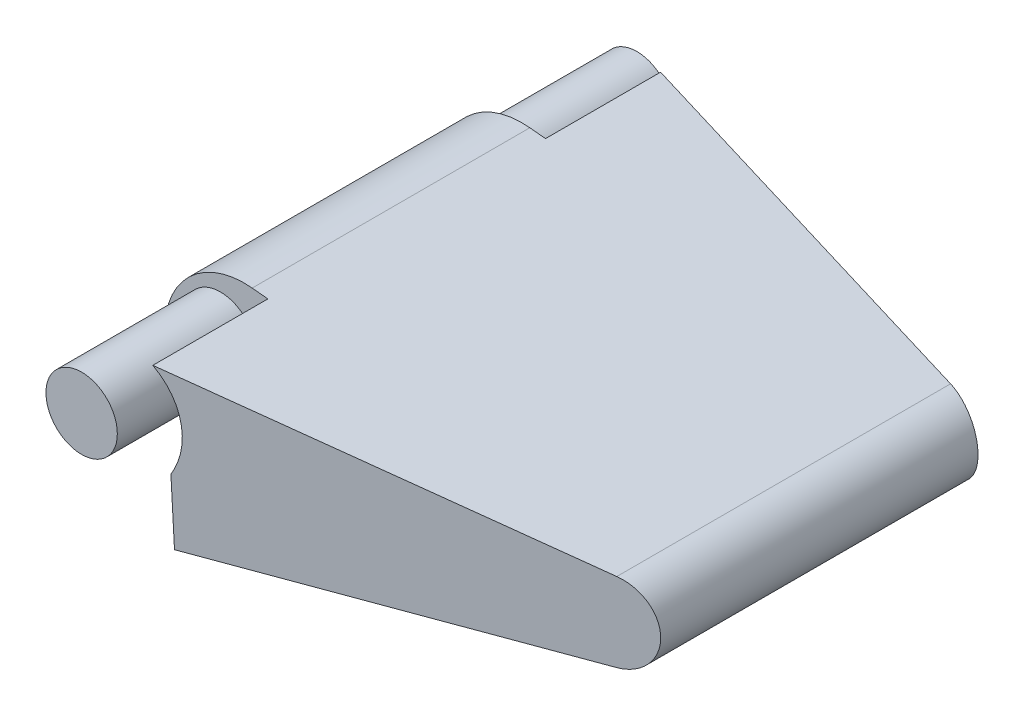
ISO-10303-21;
HEADER;
FILE_DESCRIPTION(('STEP AP214'),'2;1');
FILE_NAME('part.step','',(''),(''),'','','');
FILE_SCHEMA(('AUTOMOTIVE_DESIGN { 1 0 10303 214 1 1 1 1 }'));
ENDSEC;
DATA;
#1=APPLICATION_CONTEXT('core data for automotive mechanical design processes');
#2=APPLICATION_PROTOCOL_DEFINITION('international standard','automotive_design',2000,#1);
#3=PRODUCT_CONTEXT('',#1,'mechanical');
#4=PRODUCT('Part','Part','',(#3));
#5=PRODUCT_RELATED_PRODUCT_CATEGORY('part','',(#4));
#6=PRODUCT_DEFINITION_FORMATION('','',#4);
#7=PRODUCT_DEFINITION_CONTEXT('part definition',#1,'design');
#8=PRODUCT_DEFINITION('design','',#6,#7);
#9=PRODUCT_DEFINITION_SHAPE('','',#8);
#10=(LENGTH_UNIT() NAMED_UNIT(*) SI_UNIT(.MILLI.,.METRE.));
#11=(NAMED_UNIT(*) PLANE_ANGLE_UNIT() SI_UNIT($,.RADIAN.));
#12=(NAMED_UNIT(*) SI_UNIT($,.STERADIAN.) SOLID_ANGLE_UNIT());
#13=UNCERTAINTY_MEASURE_WITH_UNIT(LENGTH_MEASURE(1.E-05),#10,'distance_accuracy_value','');
#14=(GEOMETRIC_REPRESENTATION_CONTEXT(3) GLOBAL_UNCERTAINTY_ASSIGNED_CONTEXT((#13)) GLOBAL_UNIT_ASSIGNED_CONTEXT((#10,
#11,#12)) REPRESENTATION_CONTEXT('',''));
#15=CARTESIAN_POINT('',(0.,0.,0.));
#16=DIRECTION('',(0.,0.,1.));
#17=DIRECTION('',(1.,0.,0.));
#18=AXIS2_PLACEMENT_3D('',#15,#16,#17);
#19=CARTESIAN_POINT('',(0.,0.,22.225));
#20=DIRECTION('',(0.,0.,-1.));
#21=DIRECTION('',(-1.,0.,0.));
#22=AXIS2_PLACEMENT_3D('',#19,#20,#21);
#23=CYLINDRICAL_SURFACE('',#22,6.35);
#24=CARTESIAN_POINT('',(0.,0.,-7.14375));
#25=DIRECTION('',(0.,0.,1.));
#26=DIRECTION('',(1.,0.,0.));
#27=AXIS2_PLACEMENT_3D('',#24,#25,#26);
#28=CIRCLE('',#27,6.35);
#29=CARTESIAN_POINT('',(-4.93940634195103,3.99058454228123,-7.14375));
#30=VERTEX_POINT('',#29);
#31=CARTESIAN_POINT('',(0.634999999999998,-6.31817022562703,-7.14375));
#32=VERTEX_POINT('',#31);
#33=EDGE_CURVE('E171',#30,#32,#28,.T.);
#34=ORIENTED_EDGE('',*,*,#33,.F.);
#35=DIRECTION('',(0.,0.,1.));
#36=VECTOR('',#35,1.);
#37=CARTESIAN_POINT('',(-4.93940634195103,3.99058454228123,-7.14375));
#38=LINE('',#37,#36);
#39=CARTESIAN_POINT('',(-4.93940634195103,3.99058454228123,-0.79375));
#40=VERTEX_POINT('',#39);
#41=EDGE_CURVE('E157',#30,#40,#38,.T.);
#42=ORIENTED_EDGE('',*,*,#41,.T.);
#43=CARTESIAN_POINT('',(0.,0.,-0.793749999999999));
#44=DIRECTION('',(0.,0.,1.));
#45=DIRECTION('',(1.,0.,0.));
#46=AXIS2_PLACEMENT_3D('',#43,#44,#45);
#47=CIRCLE('',#46,6.35);
#48=CARTESIAN_POINT('',(0.634999999999998,-6.31817022562703,-0.79375));
#49=VERTEX_POINT('',#48);
#50=EDGE_CURVE('E181',#40,#49,#47,.T.);
#51=ORIENTED_EDGE('',*,*,#50,.T.);
#52=DIRECTION('',(0.,0.,-1.));
#53=VECTOR('',#52,1.);
#54=CARTESIAN_POINT('',(0.635,-6.31817022562703,22.225));
#55=LINE('',#54,#53);
#56=CARTESIAN_POINT('',(0.635,-6.31817022562703,0.793749999999999));
#57=VERTEX_POINT('',#56);
#58=EDGE_CURVE('E285',#57,#49,#55,.T.);
#59=ORIENTED_EDGE('',*,*,#58,.F.);
#60=CARTESIAN_POINT('',(0.,0.,0.793749999999999));
#61=DIRECTION('',(0.,0.,-1.));
#62=DIRECTION('',(-1.,0.,0.));
#63=AXIS2_PLACEMENT_3D('',#60,#61,#62);
#64=CIRCLE('',#63,6.35);
#65=CARTESIAN_POINT('',(-4.93940634195103,3.99058454228123,0.79375));
#66=VERTEX_POINT('',#65);
#67=EDGE_CURVE('E54',#57,#66,#64,.T.);
#68=ORIENTED_EDGE('',*,*,#67,.T.);
#69=DIRECTION('',(0.,0.,-1.));
#70=VECTOR('',#69,1.);
#71=CARTESIAN_POINT('',(-4.93940634195103,3.99058454228123,7.14375));
#72=LINE('',#71,#70);
#73=CARTESIAN_POINT('',(-4.93940634195103,3.99058454228123,7.14375));
#74=VERTEX_POINT('',#73);
#75=EDGE_CURVE('E192',#74,#66,#72,.T.);
#76=ORIENTED_EDGE('',*,*,#75,.F.);
#77=CARTESIAN_POINT('',(0.,0.,7.14375));
#78=DIRECTION('',(0.,0.,-1.));
#79=DIRECTION('',(-1.,0.,0.));
#80=AXIS2_PLACEMENT_3D('',#77,#78,#79);
#81=CIRCLE('',#80,6.35);
#82=CARTESIAN_POINT('',(0.634999999999998,-6.31817022562703,7.14375));
#83=VERTEX_POINT('',#82);
#84=EDGE_CURVE('E206',#83,#74,#81,.T.);
#85=ORIENTED_EDGE('',*,*,#84,.F.);
#86=CARTESIAN_POINT('',(0.634999999999999,-6.31817022562703,11.1125));
#87=VERTEX_POINT('',#86);
#88=EDGE_CURVE('E281',#87,#83,#55,.T.);
#89=ORIENTED_EDGE('',*,*,#88,.F.);
#90=CARTESIAN_POINT('',(0.,0.,11.1125));
#91=DIRECTION('',(0.,0.,1.));
#92=DIRECTION('',(1.,0.,0.));
#93=AXIS2_PLACEMENT_3D('',#90,#91,#92);
#94=CIRCLE('',#93,6.35);
#95=CARTESIAN_POINT('',(0.634999999999999,6.31817022562703,11.1125));
#96=VERTEX_POINT('',#95);
#97=EDGE_CURVE('E247',#96,#87,#94,.T.);
#98=ORIENTED_EDGE('',*,*,#97,.F.);
#99=DIRECTION('',(0.,0.,-1.));
#100=VECTOR('',#99,1.);
#101=CARTESIAN_POINT('',(0.635,6.31817022562703,22.225));
#102=LINE('',#101,#100);
#103=CARTESIAN_POINT('',(0.635,6.31817022562703,-11.1125));
#104=VERTEX_POINT('',#103);
#105=EDGE_CURVE('E272',#96,#104,#102,.T.);
#106=ORIENTED_EDGE('',*,*,#105,.T.);
#107=CARTESIAN_POINT('',(0.,0.,-11.1125));
#108=DIRECTION('',(0.,0.,-1.));
#109=DIRECTION('',(-1.,0.,0.));
#110=AXIS2_PLACEMENT_3D('',#107,#108,#109);
#111=CIRCLE('',#110,6.35);
#112=CARTESIAN_POINT('',(0.634999999999999,-6.31817022562703,-11.1125));
#113=VERTEX_POINT('',#112);
#114=EDGE_CURVE('E227',#113,#104,#111,.T.);
#115=ORIENTED_EDGE('',*,*,#114,.F.);
#116=EDGE_CURVE('E179',#32,#113,#55,.T.);
#117=ORIENTED_EDGE('',*,*,#116,.F.);
#118=EDGE_LOOP('',(#34,#42,#51,#59,#68,#76,#85,#89,#98,#106,#115,#117));
#119=FACE_BOUND('',#118,.T.);
#120=ADVANCED_FACE('F32',(#119),#23,.T.);
#121=CARTESIAN_POINT('',(0.635,-6.31817022562703,22.225));
#122=DIRECTION('',(-0.1,0.99498743710662,0.));
#123=DIRECTION('',(-0.99498743710662,-0.1,0.));
#124=AXIS2_PLACEMENT_3D('',#121,#122,#123);
#125=PLANE('',#124);
#126=DIRECTION('',(0.99498743710662,0.1,0.));
#127=VECTOR('',#126,1.);
#128=CARTESIAN_POINT('',(0.635,-6.31817022562703,-7.14375));
#129=LINE('',#128,#127);
#130=CARTESIAN_POINT('',(3.29993725197575,-6.05033395427418,-7.14375));
#131=VERTEX_POINT('',#130);
#132=EDGE_CURVE('E11',#32,#131,#129,.T.);
#133=ORIENTED_EDGE('',*,*,#132,.F.);
#134=ORIENTED_EDGE('',*,*,#116,.T.);
#135=DIRECTION('',(-0.99498743710662,-0.1,0.));
#136=VECTOR('',#135,1.);
#137=CARTESIAN_POINT('',(0.635,-6.31817022562703,-11.1125));
#138=LINE('',#137,#136);
#139=CARTESIAN_POINT('',(3.29993725197575,-6.05033395427418,-11.1125));
#140=VERTEX_POINT('',#139);
#141=EDGE_CURVE('E231',#140,#113,#138,.T.);
#142=ORIENTED_EDGE('',*,*,#141,.F.);
#143=DIRECTION('',(0.,0.,-1.));
#144=VECTOR('',#143,1.);
#145=CARTESIAN_POINT('',(3.29993725197575,-6.05033395427418,-11.1125));
#146=LINE('',#145,#144);
#147=CARTESIAN_POINT('',(3.29993725197575,-6.05033395427418,-19.9980914033902));
#148=VERTEX_POINT('',#147);
#149=EDGE_CURVE('E224',#140,#148,#146,.T.);
#150=ORIENTED_EDGE('',*,*,#149,.T.);
#151=DIRECTION('',(0.969752191611782,0.0974637624000338,0.223788967295027));
#152=VECTOR('',#151,1.);
#153=CARTESIAN_POINT('',(9.93171266370637,-5.38381544716463,-18.4676816929908));
#154=LINE('',#153,#152);
#155=CARTESIAN_POINT('',(32.0675,-3.15908511281352,-13.3594230769231));
#156=VERTEX_POINT('',#155);
#157=EDGE_CURVE('E270',#148,#156,#154,.T.);
#158=ORIENTED_EDGE('',*,*,#157,.T.);
#159=DIRECTION('',(0.,0.,-1.));
#160=VECTOR('',#159,1.);
#161=CARTESIAN_POINT('',(32.0675,-3.15908511281352,22.225));
#162=LINE('',#161,#160);
#163=CARTESIAN_POINT('',(32.0675,-3.15908511281352,13.3594230769231));
#164=VERTEX_POINT('',#163);
#165=EDGE_CURVE('E278',#164,#156,#162,.T.);
#166=ORIENTED_EDGE('',*,*,#165,.F.);
#167=DIRECTION('',(-0.969752191611782,-0.0974637624000338,0.223788967295027));
#168=VECTOR('',#167,1.);
#169=CARTESIAN_POINT('',(0.285180709347423,-6.35332838718833,20.6938044516891));
#170=LINE('',#169,#168);
#171=CARTESIAN_POINT('',(3.29993725197575,-6.05033395427418,19.9980914033902));
#172=VERTEX_POINT('',#171);
#173=EDGE_CURVE('E262',#164,#172,#170,.T.);
#174=ORIENTED_EDGE('',*,*,#173,.T.);
#175=DIRECTION('',(0.,0.,1.));
#176=VECTOR('',#175,1.);
#177=CARTESIAN_POINT('',(3.29993725197575,-6.05033395427418,11.1125));
#178=LINE('',#177,#176);
#179=CARTESIAN_POINT('',(3.29993725197575,-6.05033395427418,11.1125));
#180=VERTEX_POINT('',#179);
#181=EDGE_CURVE('E243',#180,#172,#178,.T.);
#182=ORIENTED_EDGE('',*,*,#181,.F.);
#183=DIRECTION('',(0.99498743710662,0.1,0.));
#184=VECTOR('',#183,1.);
#185=CARTESIAN_POINT('',(0.635,-6.31817022562703,11.1125));
#186=LINE('',#185,#184);
#187=EDGE_CURVE('E250',#87,#180,#186,.T.);
#188=ORIENTED_EDGE('',*,*,#187,.F.);
#189=ORIENTED_EDGE('',*,*,#88,.T.);
#190=DIRECTION('',(-0.99498743710662,-0.1,0.));
#191=VECTOR('',#190,1.);
#192=CARTESIAN_POINT('',(0.635,-6.31817022562703,7.14375));
#193=LINE('',#192,#191);
#194=CARTESIAN_POINT('',(3.29993725197575,-6.05033395427418,7.14375));
#195=VERTEX_POINT('',#194);
#196=EDGE_CURVE('E39',#195,#83,#193,.T.);
#197=ORIENTED_EDGE('',*,*,#196,.F.);
#198=DIRECTION('',(0.,0.,-1.));
#199=VECTOR('',#198,1.);
#200=CARTESIAN_POINT('',(3.29993725197575,-6.05033395427418,7.14375));
#201=LINE('',#200,#199);
#202=CARTESIAN_POINT('',(3.29993725197575,-6.05033395427418,0.79375));
#203=VERTEX_POINT('',#202);
#204=EDGE_CURVE('E201',#195,#203,#201,.T.);
#205=ORIENTED_EDGE('',*,*,#204,.T.);
#206=DIRECTION('',(0.99498743710662,0.0999999999999998,0.));
#207=VECTOR('',#206,1.);
#208=CARTESIAN_POINT('',(3.29993725197575,-6.05033395427418,0.79375));
#209=LINE('',#208,#207);
#210=EDGE_CURVE('E180',#57,#203,#209,.T.);
#211=ORIENTED_EDGE('',*,*,#210,.F.);
#212=ORIENTED_EDGE('',*,*,#58,.T.);
#213=DIRECTION('',(0.99498743710662,0.0999999999999998,0.));
#214=VECTOR('',#213,1.);
#215=CARTESIAN_POINT('',(3.29993725197575,-6.05033395427418,-0.79375));
#216=LINE('',#215,#214);
#217=CARTESIAN_POINT('',(3.29993725197575,-6.05033395427418,-0.793749999999999));
#218=VERTEX_POINT('',#217);
#219=EDGE_CURVE('E175',#49,#218,#216,.T.);
#220=ORIENTED_EDGE('',*,*,#219,.T.);
#221=DIRECTION('',(0.,0.,1.));
#222=VECTOR('',#221,1.);
#223=CARTESIAN_POINT('',(3.29993725197575,-6.05033395427418,-7.14375));
#224=LINE('',#223,#222);
#225=EDGE_CURVE('E311',#131,#218,#224,.T.);
#226=ORIENTED_EDGE('',*,*,#225,.F.);
#227=EDGE_LOOP('',(#133,#134,#142,#150,#158,#166,#174,#182,#188,#189,#197,#205,#211,#212,#220,#226));
#228=FACE_BOUND('',#227,.T.);
#229=ADVANCED_FACE('F320',(#228),#125,.F.);
#230=CARTESIAN_POINT('',(-6.35,-6.35,-22.225));
#231=DIRECTION('',(-0.224859506698758,0.,0.97439119569462));
#232=DIRECTION('',(0.97439119569462,0.,0.224859506698758));
#233=AXIS2_PLACEMENT_3D('',#230,#231,#232);
#234=PLANE('',#233);
#235=CARTESIAN_POINT('',(-1.90827372570681,1.92065288556692,-21.1999862443939));
#236=DIRECTION('',(-0.224859506698758,0.,0.97439119569462));
#237=DIRECTION('',(-0.97439119569462,0.,-0.224859506698758));
#238=AXIS2_PLACEMENT_3D('',#235,#236,#237);
#239=ELLIPSE('',#238,5.86520077896015,5.715);
#240=CARTESIAN_POINT('',(1.88845779571958,6.19219297717407,-20.323817431757));
#241=VERTEX_POINT('',#240);
#242=CARTESIAN_POINT('',(3.06448900890805,-0.895879696390154,-20.0524256133289));
#243=VERTEX_POINT('',#242);
#244=EDGE_CURVE('E234',#241,#243,#239,.F.);
#245=ORIENTED_EDGE('',*,*,#244,.F.);
#246=DIRECTION('',(-0.969752191611782,0.0974637624000338,-0.223788967295027));
#247=VECTOR('',#246,1.);
#248=CARTESIAN_POINT('',(9.93171266370637,5.38381544716463,-18.4676816929908));
#249=LINE('',#248,#247);
#250=CARTESIAN_POINT('',(32.0675,3.15908511281352,-13.3594230769231));
#251=VERTEX_POINT('',#250);
#252=EDGE_CURVE('E265',#251,#241,#249,.T.);
#253=ORIENTED_EDGE('',*,*,#252,.F.);
#254=CARTESIAN_POINT('',(31.75,0.,-13.4326923076923));
#255=DIRECTION('',(-0.224859506698758,0.,0.97439119569462));
#256=DIRECTION('',(-0.97439119569462,0.,-0.224859506698758));
#257=AXIS2_PLACEMENT_3D('',#254,#255,#256);
#258=ELLIPSE('',#257,3.25844487720008,3.175);
#259=EDGE_CURVE('E268',#156,#251,#258,.T.);
#260=ORIENTED_EDGE('',*,*,#259,.F.);
#261=ORIENTED_EDGE('',*,*,#157,.F.);
#262=DIRECTION('',(0.0456284875865692,-0.998902982061206,0.010529650981516));
#263=VECTOR('',#262,1.);
#264=CARTESIAN_POINT('',(3.29243486521245,-5.88609102388512,-19.9998227234125));
#265=LINE('',#264,#263);
#266=EDGE_CURVE('E236',#243,#148,#265,.T.);
#267=ORIENTED_EDGE('',*,*,#266,.F.);
#268=EDGE_LOOP('',(#245,#253,#260,#261,#267));
#269=FACE_BOUND('',#268,.T.);
#270=ADVANCED_FACE('F345',(#269),#234,.F.);
#271=CARTESIAN_POINT('',(0.635,6.31817022562703,22.225));
#272=DIRECTION('',(-0.1,-0.99498743710662,0.));
#273=DIRECTION('',(0.99498743710662,-0.1,0.));
#274=AXIS2_PLACEMENT_3D('',#271,#272,#273);
#275=PLANE('',#274);
#276=DIRECTION('',(0.,0.,-1.));
#277=VECTOR('',#276,1.);
#278=CARTESIAN_POINT('',(1.88845779571958,6.19219297717407,-11.1125));
#279=LINE('',#278,#277);
#280=CARTESIAN_POINT('',(1.88845779571958,6.19219297717407,-11.1125));
#281=VERTEX_POINT('',#280);
#282=EDGE_CURVE('E292',#281,#241,#279,.T.);
#283=ORIENTED_EDGE('',*,*,#282,.F.);
#284=DIRECTION('',(0.99498743710662,-0.1,0.));
#285=VECTOR('',#284,1.);
#286=CARTESIAN_POINT('',(0.635,6.31817022562703,-11.1125));
#287=LINE('',#286,#285);
#288=EDGE_CURVE('E290',#104,#281,#287,.T.);
#289=ORIENTED_EDGE('',*,*,#288,.F.);
#290=ORIENTED_EDGE('',*,*,#105,.F.);
#291=DIRECTION('',(-0.99498743710662,0.1,0.));
#292=VECTOR('',#291,1.);
#293=CARTESIAN_POINT('',(0.635,6.31817022562703,11.1125));
#294=LINE('',#293,#292);
#295=CARTESIAN_POINT('',(1.88845779571958,6.19219297717407,11.1125));
#296=VERTEX_POINT('',#295);
#297=EDGE_CURVE('E284',#296,#96,#294,.T.);
#298=ORIENTED_EDGE('',*,*,#297,.F.);
#299=DIRECTION('',(0.,0.,1.));
#300=VECTOR('',#299,1.);
#301=CARTESIAN_POINT('',(1.88845779571958,6.19219297717407,11.1125));
#302=LINE('',#301,#300);
#303=CARTESIAN_POINT('',(1.88845779571958,6.19219297717407,20.323817431757));
#304=VERTEX_POINT('',#303);
#305=EDGE_CURVE('E287',#296,#304,#302,.T.);
#306=ORIENTED_EDGE('',*,*,#305,.T.);
#307=DIRECTION('',(0.969752191611782,-0.0974637624000338,-0.223788967295027));
#308=VECTOR('',#307,1.);
#309=CARTESIAN_POINT('',(0.285180709347423,6.35332838718833,20.6938044516891));
#310=LINE('',#309,#308);
#311=CARTESIAN_POINT('',(32.0675,3.15908511281352,13.3594230769231));
#312=VERTEX_POINT('',#311);
#313=EDGE_CURVE('E258',#304,#312,#310,.T.);
#314=ORIENTED_EDGE('',*,*,#313,.T.);
#315=DIRECTION('',(0.,0.,-1.));
#316=VECTOR('',#315,1.);
#317=CARTESIAN_POINT('',(32.0675,3.15908511281352,22.225));
#318=LINE('',#317,#316);
#319=EDGE_CURVE('E275',#312,#251,#318,.T.);
#320=ORIENTED_EDGE('',*,*,#319,.T.);
#321=ORIENTED_EDGE('',*,*,#252,.T.);
#322=EDGE_LOOP('',(#283,#289,#290,#298,#306,#314,#320,#321));
#323=FACE_BOUND('',#322,.T.);
#324=ADVANCED_FACE('F335',(#323),#275,.F.);
#325=CARTESIAN_POINT('',(-6.35,-6.35,22.225));
#326=DIRECTION('',(-0.224859506698758,0.,-0.97439119569462));
#327=DIRECTION('',(-0.97439119569462,0.,0.224859506698758));
#328=AXIS2_PLACEMENT_3D('',#325,#326,#327);
#329=PLANE('',#328);
#330=ORIENTED_EDGE('',*,*,#313,.F.);
#331=CARTESIAN_POINT('',(-1.90827372570681,1.92065288556692,21.1999862443939));
#332=DIRECTION('',(-0.224859506698758,0.,-0.97439119569462));
#333=DIRECTION('',(-0.97439119569462,0.,0.224859506698758));
#334=AXIS2_PLACEMENT_3D('',#331,#332,#333);
#335=ELLIPSE('',#334,5.86520077896015,5.715);
#336=CARTESIAN_POINT('',(3.06448900890805,-0.895879696390154,20.0524256133289));
#337=VERTEX_POINT('',#336);
#338=EDGE_CURVE('E252',#304,#337,#335,.T.);
#339=ORIENTED_EDGE('',*,*,#338,.T.);
#340=DIRECTION('',(0.0456284875865692,-0.998902982061206,-0.010529650981516));
#341=VECTOR('',#340,1.);
#342=CARTESIAN_POINT('',(3.29243486521245,-5.88609102388512,19.9998227234125));
#343=LINE('',#342,#341);
#344=EDGE_CURVE('E255',#337,#172,#343,.T.);
#345=ORIENTED_EDGE('',*,*,#344,.T.);
#346=ORIENTED_EDGE('',*,*,#173,.F.);
#347=CARTESIAN_POINT('',(31.75,0.,13.4326923076923));
#348=DIRECTION('',(-0.224859506698758,0.,-0.97439119569462));
#349=DIRECTION('',(0.97439119569462,0.,-0.224859506698758));
#350=AXIS2_PLACEMENT_3D('',#347,#348,#349);
#351=ELLIPSE('',#350,3.25844487720008,3.175);
#352=EDGE_CURVE('E260',#312,#164,#351,.T.);
#353=ORIENTED_EDGE('',*,*,#352,.F.);
#354=EDGE_LOOP('',(#330,#339,#345,#346,#353));
#355=FACE_BOUND('',#354,.T.);
#356=ADVANCED_FACE('F357',(#355),#329,.F.);
#357=CARTESIAN_POINT('',(31.75,0.,22.225));
#358=DIRECTION('',(0.,0.,-1.));
#359=DIRECTION('',(-1.,0.,0.));
#360=AXIS2_PLACEMENT_3D('',#357,#358,#359);
#361=CYLINDRICAL_SURFACE('',#360,3.175);
#362=ORIENTED_EDGE('',*,*,#259,.T.);
#363=ORIENTED_EDGE('',*,*,#319,.F.);
#364=ORIENTED_EDGE('',*,*,#352,.T.);
#365=ORIENTED_EDGE('',*,*,#165,.T.);
#366=EDGE_LOOP('',(#362,#363,#364,#365));
#367=FACE_BOUND('',#366,.T.);
#368=ADVANCED_FACE('F352',(#367),#361,.T.);
#369=CARTESIAN_POINT('',(3.06448900890805,-0.895879696390155,11.1125));
#370=DIRECTION('',(0.998958362626188,0.0456310172931245,0.));
#371=DIRECTION('',(-0.0456310172931245,0.998958362626188,0.));
#372=AXIS2_PLACEMENT_3D('',#369,#370,#371);
#373=PLANE('',#372);
#374=DIRECTION('',(0.,0.,1.));
#375=VECTOR('',#374,1.);
#376=CARTESIAN_POINT('',(3.06448900890805,-0.895879696390155,11.1125));
#377=LINE('',#376,#375);
#378=CARTESIAN_POINT('',(3.06448900890805,-0.895879696390155,11.1125));
#379=VERTEX_POINT('',#378);
#380=EDGE_CURVE('E244',#379,#337,#377,.T.);
#381=ORIENTED_EDGE('',*,*,#380,.F.);
#382=DIRECTION('',(-0.0456310172931245,0.998958362626188,0.));
#383=VECTOR('',#382,1.);
#384=CARTESIAN_POINT('',(3.06448900890805,-0.895879696390155,11.1125));
#385=LINE('',#384,#383);
#386=EDGE_CURVE('E240',#180,#379,#385,.T.);
#387=ORIENTED_EDGE('',*,*,#386,.F.);
#388=ORIENTED_EDGE('',*,*,#181,.T.);
#389=ORIENTED_EDGE('',*,*,#344,.F.);
#390=EDGE_LOOP('',(#381,#387,#388,#389));
#391=FACE_BOUND('',#390,.T.);
#392=ADVANCED_FACE('F359',(#391),#373,.F.);
#393=CARTESIAN_POINT('',(-1.90827372570681,1.92065288556692,11.1125));
#394=DIRECTION('',(0.,0.,1.));
#395=DIRECTION('',(1.,0.,0.));
#396=AXIS2_PLACEMENT_3D('',#393,#394,#395);
#397=CYLINDRICAL_SURFACE('',#396,5.715);
#398=ORIENTED_EDGE('',*,*,#305,.F.);
#399=CARTESIAN_POINT('',(-1.90827372570681,1.92065288556692,11.1125));
#400=DIRECTION('',(0.,0.,1.));
#401=DIRECTION('',(1.,0.,0.));
#402=AXIS2_PLACEMENT_3D('',#399,#400,#401);
#403=CIRCLE('',#402,5.715);
#404=EDGE_CURVE('E238',#379,#296,#403,.T.);
#405=ORIENTED_EDGE('',*,*,#404,.F.);
#406=ORIENTED_EDGE('',*,*,#380,.T.);
#407=ORIENTED_EDGE('',*,*,#338,.F.);
#408=EDGE_LOOP('',(#398,#405,#406,#407));
#409=FACE_BOUND('',#408,.T.);
#410=ADVANCED_FACE('F364',(#409),#397,.F.);
#411=CARTESIAN_POINT('',(-1.90827372570681,1.92065288556692,11.1125));
#412=DIRECTION('',(0.,0.,1.));
#413=DIRECTION('',(1.,0.,0.));
#414=AXIS2_PLACEMENT_3D('',#411,#412,#413);
#415=PLANE('',#414);
#416=CARTESIAN_POINT('',(-1.90827372570681,1.92065288556692,11.1125));
#417=DIRECTION('',(0.,0.,1.));
#418=DIRECTION('',(1.,0.,0.));
#419=AXIS2_PLACEMENT_3D('',#416,#417,#418);
#420=CIRCLE('',#419,2.8575);
#421=CARTESIAN_POINT('',(0.94922627429319,1.92065288556692,11.1125));
#422=VERTEX_POINT('',#421);
#423=EDGE_CURVE('E215',#422,#422,#420,.F.);
#424=ORIENTED_EDGE('',*,*,#423,.T.);
#425=EDGE_LOOP('',(#424));
#426=FACE_BOUND('',#425,.T.);
#427=ORIENTED_EDGE('',*,*,#187,.T.);
#428=ORIENTED_EDGE('',*,*,#386,.T.);
#429=ORIENTED_EDGE('',*,*,#404,.T.);
#430=ORIENTED_EDGE('',*,*,#297,.T.);
#431=ORIENTED_EDGE('',*,*,#97,.T.);
#432=EDGE_LOOP('',(#427,#428,#429,#430,#431));
#433=FACE_BOUND('',#432,.T.);
#434=ADVANCED_FACE('F366',(#426,#433),#415,.T.);
#435=CARTESIAN_POINT('',(3.06448900890805,-0.895879696390155,-11.1125));
#436=DIRECTION('',(-0.998958362626188,-0.0456310172931245,0.));
#437=DIRECTION('',(0.0456310172931245,-0.998958362626188,0.));
#438=AXIS2_PLACEMENT_3D('',#435,#436,#437);
#439=PLANE('',#438);
#440=ORIENTED_EDGE('',*,*,#266,.T.);
#441=ORIENTED_EDGE('',*,*,#149,.F.);
#442=DIRECTION('',(-0.0456310172931245,0.998958362626188,0.));
#443=VECTOR('',#442,1.);
#444=CARTESIAN_POINT('',(3.06448900890805,-0.895879696390155,-11.1125));
#445=LINE('',#444,#443);
#446=CARTESIAN_POINT('',(3.06448900890805,-0.895879696390155,-11.1125));
#447=VERTEX_POINT('',#446);
#448=EDGE_CURVE('E221',#140,#447,#445,.T.);
#449=ORIENTED_EDGE('',*,*,#448,.T.);
#450=DIRECTION('',(0.,0.,-1.));
#451=VECTOR('',#450,1.);
#452=CARTESIAN_POINT('',(3.06448900890805,-0.895879696390155,-11.1125));
#453=LINE('',#452,#451);
#454=EDGE_CURVE('E223',#447,#243,#453,.T.);
#455=ORIENTED_EDGE('',*,*,#454,.T.);
#456=EDGE_LOOP('',(#440,#441,#449,#455));
#457=FACE_BOUND('',#456,.T.);
#458=ADVANCED_FACE('F342',(#457),#439,.T.);
#459=CARTESIAN_POINT('',(-1.90827372570681,1.92065288556692,-11.1125));
#460=DIRECTION('',(0.,0.,-1.));
#461=DIRECTION('',(-1.,0.,0.));
#462=AXIS2_PLACEMENT_3D('',#459,#460,#461);
#463=CYLINDRICAL_SURFACE('',#462,5.715);
#464=ORIENTED_EDGE('',*,*,#244,.T.);
#465=ORIENTED_EDGE('',*,*,#454,.F.);
#466=CARTESIAN_POINT('',(-1.90827372570681,1.92065288556692,-11.1125));
#467=DIRECTION('',(0.,0.,1.));
#468=DIRECTION('',(1.,0.,0.));
#469=AXIS2_PLACEMENT_3D('',#466,#467,#468);
#470=CIRCLE('',#469,5.715);
#471=EDGE_CURVE('E218',#447,#281,#470,.T.);
#472=ORIENTED_EDGE('',*,*,#471,.T.);
#473=ORIENTED_EDGE('',*,*,#282,.T.);
#474=EDGE_LOOP('',(#464,#465,#472,#473));
#475=FACE_BOUND('',#474,.T.);
#476=ADVANCED_FACE('F338',(#475),#463,.F.);
#477=CARTESIAN_POINT('',(-1.90827372570681,1.92065288556692,-11.1125));
#478=DIRECTION('',(0.,0.,-1.));
#479=DIRECTION('',(1.,0.,0.));
#480=AXIS2_PLACEMENT_3D('',#477,#478,#479);
#481=PLANE('',#480);
#482=CARTESIAN_POINT('',(-1.90827372570681,1.92065288556692,-11.1125));
#483=DIRECTION('',(0.,0.,-1.));
#484=DIRECTION('',(-1.,0.,0.));
#485=AXIS2_PLACEMENT_3D('',#482,#483,#484);
#486=CIRCLE('',#485,2.8575);
#487=CARTESIAN_POINT('',(-4.76577372570681,1.92065288556692,-11.1125));
#488=VERTEX_POINT('',#487);
#489=EDGE_CURVE('E212',#488,#488,#486,.F.);
#490=ORIENTED_EDGE('',*,*,#489,.T.);
#491=EDGE_LOOP('',(#490));
#492=FACE_BOUND('',#491,.T.);
#493=ORIENTED_EDGE('',*,*,#141,.T.);
#494=ORIENTED_EDGE('',*,*,#114,.T.);
#495=ORIENTED_EDGE('',*,*,#288,.T.);
#496=ORIENTED_EDGE('',*,*,#471,.F.);
#497=ORIENTED_EDGE('',*,*,#448,.F.);
#498=EDGE_LOOP('',(#493,#494,#495,#496,#497));
#499=FACE_BOUND('',#498,.T.);
#500=ADVANCED_FACE('F326',(#492,#499),#481,.T.);
#501=CARTESIAN_POINT('',(-1.90827372570681,1.92065288556692,-22.225));
#502=DIRECTION('',(0.,0.,1.));
#503=DIRECTION('',(1.,0.,0.));
#504=AXIS2_PLACEMENT_3D('',#501,#502,#503);
#505=PLANE('',#504);
#506=CARTESIAN_POINT('',(-1.90827372570681,1.92065288556692,-22.225));
#507=DIRECTION('',(0.,0.,1.));
#508=DIRECTION('',(1.,0.,0.));
#509=AXIS2_PLACEMENT_3D('',#506,#507,#508);
#510=CIRCLE('',#509,2.8575);
#511=CARTESIAN_POINT('',(0.94922627429319,1.92065288556692,-22.225));
#512=VERTEX_POINT('',#511);
#513=EDGE_CURVE('E208',#512,#512,#510,.T.);
#514=ORIENTED_EDGE('',*,*,#513,.F.);
#515=EDGE_LOOP('',(#514));
#516=FACE_BOUND('',#515,.T.);
#517=ADVANCED_FACE('F424',(#516),#505,.F.);
#518=CARTESIAN_POINT('',(-1.90827372570681,1.92065288556692,22.225));
#519=DIRECTION('',(0.,0.,-1.));
#520=DIRECTION('',(-1.,0.,0.));
#521=AXIS2_PLACEMENT_3D('',#518,#519,#520);
#522=CYLINDRICAL_SURFACE('',#521,2.8575);
#523=ORIENTED_EDGE('',*,*,#489,.F.);
#524=EDGE_LOOP('',(#523));
#525=FACE_BOUND('',#524,.T.);
#526=ORIENTED_EDGE('',*,*,#513,.T.);
#527=EDGE_LOOP('',(#526));
#528=FACE_BOUND('',#527,.T.);
#529=ADVANCED_FACE('F426',(#525,#528),#522,.T.);
#530=ORIENTED_EDGE('',*,*,#423,.F.);
#531=EDGE_LOOP('',(#530));
#532=FACE_BOUND('',#531,.T.);
#533=CARTESIAN_POINT('',(-1.90827372570681,1.92065288556692,22.225));
#534=DIRECTION('',(0.,0.,1.));
#535=DIRECTION('',(1.,0.,0.));
#536=AXIS2_PLACEMENT_3D('',#533,#534,#535);
#537=CIRCLE('',#536,2.8575);
#538=CARTESIAN_POINT('',(0.94922627429319,1.92065288556692,22.225));
#539=VERTEX_POINT('',#538);
#540=EDGE_CURVE('E209',#539,#539,#537,.T.);
#541=ORIENTED_EDGE('',*,*,#540,.F.);
#542=EDGE_LOOP('',(#541));
#543=FACE_BOUND('',#542,.T.);
#544=ADVANCED_FACE('F429',(#532,#543),#522,.T.);
#545=CARTESIAN_POINT('',(-1.90827372570681,1.92065288556692,22.225));
#546=DIRECTION('',(0.,0.,1.));
#547=DIRECTION('',(1.,0.,0.));
#548=AXIS2_PLACEMENT_3D('',#545,#546,#547);
#549=PLANE('',#548);
#550=ORIENTED_EDGE('',*,*,#540,.T.);
#551=EDGE_LOOP('',(#550));
#552=FACE_BOUND('',#551,.T.);
#553=ADVANCED_FACE('F390',(#552),#549,.T.);
#554=CARTESIAN_POINT('',(0.,0.,7.14375));
#555=DIRECTION('',(0.,0.,-1.));
#556=DIRECTION('',(-1.,0.,0.));
#557=AXIS2_PLACEMENT_3D('',#554,#555,#556);
#558=PLANE('',#557);
#559=ORIENTED_EDGE('',*,*,#84,.T.);
#560=DIRECTION('',(-0.853509743523386,0.521076882725231,0.));
#561=VECTOR('',#560,1.);
#562=CARTESIAN_POINT('',(-4.93940634195103,3.99058454228123,7.14375));
#563=LINE('',#562,#561);
#564=CARTESIAN_POINT('',(3.06448900890805,-0.895879696390155,7.14375));
#565=VERTEX_POINT('',#564);
#566=EDGE_CURVE('E189',#565,#74,#563,.T.);
#567=ORIENTED_EDGE('',*,*,#566,.F.);
#568=DIRECTION('',(-0.0456310172931245,0.998958362626188,0.));
#569=VECTOR('',#568,1.);
#570=CARTESIAN_POINT('',(3.06448900890805,-0.895879696390155,7.14375));
#571=LINE('',#570,#569);
#572=EDGE_CURVE('E187',#195,#565,#571,.T.);
#573=ORIENTED_EDGE('',*,*,#572,.F.);
#574=ORIENTED_EDGE('',*,*,#196,.T.);
#575=EDGE_LOOP('',(#559,#567,#573,#574));
#576=FACE_BOUND('',#575,.T.);
#577=ADVANCED_FACE('F372',(#576),#558,.T.);
#578=CARTESIAN_POINT('',(0.,0.,0.79375));
#579=DIRECTION('',(0.,0.,-1.));
#580=DIRECTION('',(-1.,0.,0.));
#581=AXIS2_PLACEMENT_3D('',#578,#579,#580);
#582=PLANE('',#581);
#583=CARTESIAN_POINT('',(0.,-1.5875,0.79375));
#584=DIRECTION('',(0.,0.,-1.));
#585=DIRECTION('',(-1.,0.,0.));
#586=AXIS2_PLACEMENT_3D('',#583,#584,#585);
#587=CIRCLE('',#586,0.952500000000001);
#588=CARTESIAN_POINT('',(-0.9525,-1.5875,0.79375));
#589=VERTEX_POINT('',#588);
#590=EDGE_CURVE('E204',#589,#589,#587,.F.);
#591=ORIENTED_EDGE('',*,*,#590,.F.);
#592=EDGE_LOOP('',(#591));
#593=FACE_BOUND('',#592,.T.);
#594=ORIENTED_EDGE('',*,*,#210,.T.);
#595=DIRECTION('',(-0.0456310172931245,0.998958362626188,0.));
#596=VECTOR('',#595,1.);
#597=CARTESIAN_POINT('',(3.06448900890805,-0.895879696390155,0.79375));
#598=LINE('',#597,#596);
#599=CARTESIAN_POINT('',(3.06448900890805,-0.895879696390155,0.79375));
#600=VERTEX_POINT('',#599);
#601=EDGE_CURVE('E183',#203,#600,#598,.T.);
#602=ORIENTED_EDGE('',*,*,#601,.T.);
#603=DIRECTION('',(-0.853509743523386,0.521076882725231,0.));
#604=VECTOR('',#603,1.);
#605=CARTESIAN_POINT('',(-4.93940634195103,3.99058454228123,0.79375));
#606=LINE('',#605,#604);
#607=EDGE_CURVE('E190',#600,#66,#606,.T.);
#608=ORIENTED_EDGE('',*,*,#607,.T.);
#609=ORIENTED_EDGE('',*,*,#67,.F.);
#610=EDGE_LOOP('',(#594,#602,#608,#609));
#611=FACE_BOUND('',#610,.T.);
#612=ADVANCED_FACE('F381',(#593,#611),#582,.F.);
#613=CARTESIAN_POINT('',(3.06448900890805,-0.895879696390155,7.14375));
#614=DIRECTION('',(-0.998958362626188,-0.0456310172931245,0.));
#615=DIRECTION('',(0.0456310172931245,-0.998958362626188,0.));
#616=AXIS2_PLACEMENT_3D('',#613,#614,#615);
#617=PLANE('',#616);
#618=ORIENTED_EDGE('',*,*,#601,.F.);
#619=ORIENTED_EDGE('',*,*,#204,.F.);
#620=ORIENTED_EDGE('',*,*,#572,.T.);
#621=DIRECTION('',(0.,0.,-1.));
#622=VECTOR('',#621,1.);
#623=CARTESIAN_POINT('',(3.06448900890805,-0.895879696390155,7.14375));
#624=LINE('',#623,#622);
#625=EDGE_CURVE('E198',#565,#600,#624,.T.);
#626=ORIENTED_EDGE('',*,*,#625,.T.);
#627=EDGE_LOOP('',(#618,#619,#620,#626));
#628=FACE_BOUND('',#627,.T.);
#629=ADVANCED_FACE('F380',(#628),#617,.T.);
#630=CARTESIAN_POINT('',(-4.93940634195103,3.99058454228123,7.14375));
#631=DIRECTION('',(-0.52107688272523,-0.853509743523386,0.));
#632=DIRECTION('',(0.853509743523386,-0.521076882725231,0.));
#633=AXIS2_PLACEMENT_3D('',#630,#631,#632);
#634=PLANE('',#633);
#635=ORIENTED_EDGE('',*,*,#607,.F.);
#636=ORIENTED_EDGE('',*,*,#625,.F.);
#637=ORIENTED_EDGE('',*,*,#566,.T.);
#638=ORIENTED_EDGE('',*,*,#75,.T.);
#639=EDGE_LOOP('',(#635,#636,#637,#638));
#640=FACE_BOUND('',#639,.T.);
#641=ADVANCED_FACE('F377',(#640),#634,.T.);
#642=CARTESIAN_POINT('',(0.,-1.5875,-0.9525));
#643=DIRECTION('',(0.,0.,1.));
#644=DIRECTION('',(1.,0.,0.));
#645=AXIS2_PLACEMENT_3D('',#642,#643,#644);
#646=CYLINDRICAL_SURFACE('',#645,0.952500000000001);
#647=CARTESIAN_POINT('',(0.,-1.5875,-0.79375));
#648=DIRECTION('',(0.,0.,1.));
#649=DIRECTION('',(1.,0.,0.));
#650=AXIS2_PLACEMENT_3D('',#647,#648,#649);
#651=CIRCLE('',#650,0.952500000000001);
#652=CARTESIAN_POINT('',(0.952500000000001,-1.5875,-0.79375));
#653=VERTEX_POINT('',#652);
#654=EDGE_CURVE('E166',#653,#653,#651,.F.);
#655=ORIENTED_EDGE('',*,*,#654,.T.);
#656=EDGE_LOOP('',(#655));
#657=FACE_BOUND('',#656,.T.);
#658=ORIENTED_EDGE('',*,*,#590,.T.);
#659=EDGE_LOOP('',(#658));
#660=FACE_BOUND('',#659,.T.);
#661=ADVANCED_FACE('F301',(#657,#660),#646,.F.);
#662=CARTESIAN_POINT('',(0.,0.,-7.14375));
#663=DIRECTION('',(0.,0.,1.));
#664=DIRECTION('',(-1.,0.,0.));
#665=AXIS2_PLACEMENT_3D('',#662,#663,#664);
#666=PLANE('',#665);
#667=ORIENTED_EDGE('',*,*,#33,.T.);
#668=ORIENTED_EDGE('',*,*,#132,.T.);
#669=DIRECTION('',(-0.0456310172931245,0.998958362626188,0.));
#670=VECTOR('',#669,1.);
#671=CARTESIAN_POINT('',(3.06448900890805,-0.895879696390155,-7.14375));
#672=LINE('',#671,#670);
#673=CARTESIAN_POINT('',(3.06448900890805,-0.895879696390155,-7.14375));
#674=VERTEX_POINT('',#673);
#675=EDGE_CURVE('E174',#131,#674,#672,.T.);
#676=ORIENTED_EDGE('',*,*,#675,.T.);
#677=DIRECTION('',(-0.853509743523386,0.521076882725231,0.));
#678=VECTOR('',#677,1.);
#679=CARTESIAN_POINT('',(-4.93940634195103,3.99058454228123,-7.14375));
#680=LINE('',#679,#678);
#681=EDGE_CURVE('E160',#674,#30,#680,.T.);
#682=ORIENTED_EDGE('',*,*,#681,.T.);
#683=EDGE_LOOP('',(#667,#668,#676,#682));
#684=FACE_BOUND('',#683,.T.);
#685=ADVANCED_FACE('F170',(#684),#666,.T.);
#686=CARTESIAN_POINT('',(0.,0.,-0.79375));
#687=DIRECTION('',(0.,0.,1.));
#688=DIRECTION('',(-1.,0.,0.));
#689=AXIS2_PLACEMENT_3D('',#686,#687,#688);
#690=PLANE('',#689);
#691=ORIENTED_EDGE('',*,*,#654,.F.);
#692=EDGE_LOOP('',(#691));
#693=FACE_BOUND('',#692,.T.);
#694=DIRECTION('',(-0.853509743523386,0.521076882725231,0.));
#695=VECTOR('',#694,1.);
#696=CARTESIAN_POINT('',(-4.93940634195103,3.99058454228123,-0.79375));
#697=LINE('',#696,#695);
#698=CARTESIAN_POINT('',(3.06448900890805,-0.895879696390155,-0.79375));
#699=VERTEX_POINT('',#698);
#700=EDGE_CURVE('E162',#699,#40,#697,.T.);
#701=ORIENTED_EDGE('',*,*,#700,.F.);
#702=DIRECTION('',(-0.0456310172931245,0.998958362626188,0.));
#703=VECTOR('',#702,1.);
#704=CARTESIAN_POINT('',(3.06448900890805,-0.895879696390155,-0.79375));
#705=LINE('',#704,#703);
#706=EDGE_CURVE('E46',#218,#699,#705,.T.);
#707=ORIENTED_EDGE('',*,*,#706,.F.);
#708=ORIENTED_EDGE('',*,*,#219,.F.);
#709=ORIENTED_EDGE('',*,*,#50,.F.);
#710=EDGE_LOOP('',(#701,#707,#708,#709));
#711=FACE_BOUND('',#710,.T.);
#712=ADVANCED_FACE('F304',(#693,#711),#690,.F.);
#713=CARTESIAN_POINT('',(-4.93940634195103,3.99058454228123,-7.14375));
#714=DIRECTION('',(0.52107688272523,0.853509743523386,0.));
#715=DIRECTION('',(-0.853509743523386,0.521076882725231,0.));
#716=AXIS2_PLACEMENT_3D('',#713,#714,#715);
#717=PLANE('',#716);
#718=ORIENTED_EDGE('',*,*,#700,.T.);
#719=ORIENTED_EDGE('',*,*,#41,.F.);
#720=ORIENTED_EDGE('',*,*,#681,.F.);
#721=DIRECTION('',(0.,0.,1.));
#722=VECTOR('',#721,1.);
#723=CARTESIAN_POINT('',(3.06448900890805,-0.895879696390155,-7.14375));
#724=LINE('',#723,#722);
#725=EDGE_CURVE('E167',#674,#699,#724,.T.);
#726=ORIENTED_EDGE('',*,*,#725,.T.);
#727=EDGE_LOOP('',(#718,#719,#720,#726));
#728=FACE_BOUND('',#727,.T.);
#729=ADVANCED_FACE('F159',(#728),#717,.F.);
#730=CARTESIAN_POINT('',(3.06448900890805,-0.895879696390155,-7.14375));
#731=DIRECTION('',(0.998958362626188,0.0456310172931245,0.));
#732=DIRECTION('',(-0.0456310172931245,0.998958362626188,0.));
#733=AXIS2_PLACEMENT_3D('',#730,#731,#732);
#734=PLANE('',#733);
#735=ORIENTED_EDGE('',*,*,#706,.T.);
#736=ORIENTED_EDGE('',*,*,#725,.F.);
#737=ORIENTED_EDGE('',*,*,#675,.F.);
#738=ORIENTED_EDGE('',*,*,#225,.T.);
#739=EDGE_LOOP('',(#735,#736,#737,#738));
#740=FACE_BOUND('',#739,.T.);
#741=ADVANCED_FACE('F309',(#740),#734,.F.);
#742=CLOSED_SHELL('',(#120,#229,#270,#324,#356,#368,#392,#410,#434,#458,#476,#500,#517,#529,
#544,#553,#577,#612,#629,#641,#661,#685,#712,#729,#741));
#743=MANIFOLD_SOLID_BREP('B2',#742);
#744=ADVANCED_BREP_SHAPE_REPRESENTATION('',(#18,#743),#14);
#745=SHAPE_DEFINITION_REPRESENTATION(#9,#744);
ENDSEC;
END-ISO-10303-21;
